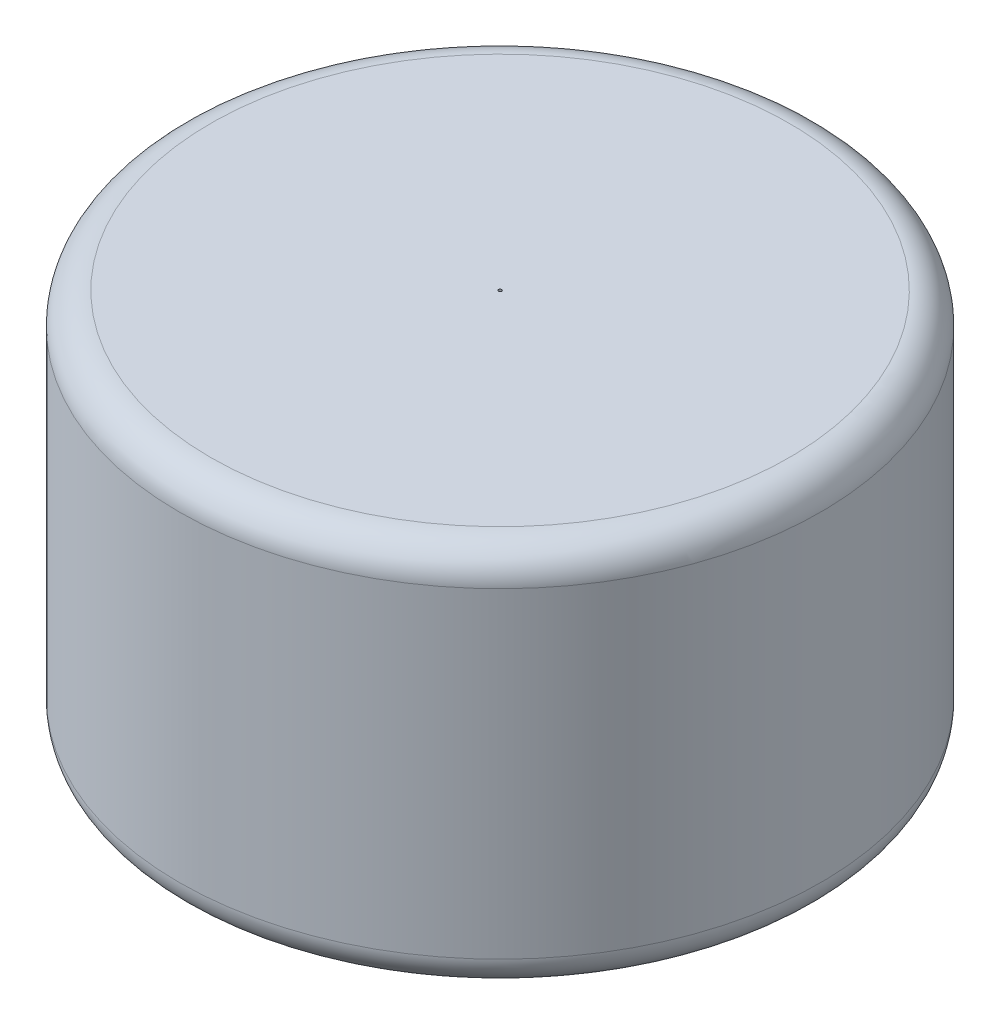
ISO-10303-21;
HEADER;
FILE_DESCRIPTION(('STEP AP214'),'2;1');
FILE_NAME('part.step','',(''),(''),'','','');
FILE_SCHEMA(('AUTOMOTIVE_DESIGN { 1 0 10303 214 1 1 1 1 }'));
ENDSEC;
DATA;
#1=APPLICATION_CONTEXT('core data for automotive mechanical design processes');
#2=APPLICATION_PROTOCOL_DEFINITION('international standard','automotive_design',2000,#1);
#3=PRODUCT_CONTEXT('',#1,'mechanical');
#4=PRODUCT('Part','Part','',(#3));
#5=PRODUCT_RELATED_PRODUCT_CATEGORY('part','',(#4));
#6=PRODUCT_DEFINITION_FORMATION('','',#4);
#7=PRODUCT_DEFINITION_CONTEXT('part definition',#1,'design');
#8=PRODUCT_DEFINITION('design','',#6,#7);
#9=PRODUCT_DEFINITION_SHAPE('','',#8);
#10=(LENGTH_UNIT() NAMED_UNIT(*) SI_UNIT(.MILLI.,.METRE.));
#11=(NAMED_UNIT(*) PLANE_ANGLE_UNIT() SI_UNIT($,.RADIAN.));
#12=(NAMED_UNIT(*) SI_UNIT($,.STERADIAN.) SOLID_ANGLE_UNIT());
#13=UNCERTAINTY_MEASURE_WITH_UNIT(LENGTH_MEASURE(1.E-05),#10,'distance_accuracy_value','');
#14=(GEOMETRIC_REPRESENTATION_CONTEXT(3) GLOBAL_UNCERTAINTY_ASSIGNED_CONTEXT((#13)) GLOBAL_UNIT_ASSIGNED_CONTEXT((#10,
#11,#12)) REPRESENTATION_CONTEXT('',''));
#15=CARTESIAN_POINT('',(0.,0.,0.));
#16=DIRECTION('',(0.,0.,1.));
#17=DIRECTION('',(1.,0.,0.));
#18=AXIS2_PLACEMENT_3D('',#15,#16,#17);
#19=CARTESIAN_POINT('',(0.,51.,0.));
#20=DIRECTION('',(0.,-1.,0.));
#21=DIRECTION('',(0.,0.,-1.));
#22=AXIS2_PLACEMENT_3D('',#19,#20,#21);
#23=PLANE('',#22);
#24=CARTESIAN_POINT('',(0.,51.,0.));
#25=DIRECTION('',(0.,-1.,0.));
#26=DIRECTION('',(0.,0.,-1.));
#27=AXIS2_PLACEMENT_3D('',#24,#25,#26);
#28=CIRCLE('',#27,0.250000000000002);
#29=CARTESIAN_POINT('',(0.,51.,-0.250000000000002));
#30=VERTEX_POINT('',#29);
#31=EDGE_CURVE('E43',#30,#30,#28,.T.);
#32=ORIENTED_EDGE('',*,*,#31,.F.);
#33=EDGE_LOOP('',(#32));
#34=FACE_BOUND('',#33,.T.);
#35=CARTESIAN_POINT('',(0.,51.,0.));
#36=DIRECTION('',(0.,-1.,0.));
#37=DIRECTION('',(0.,0.,-1.));
#38=AXIS2_PLACEMENT_3D('',#35,#36,#37);
#39=CIRCLE('',#38,41.);
#40=CARTESIAN_POINT('',(0.,51.,-41.));
#41=VERTEX_POINT('',#40);
#42=EDGE_CURVE('E63',#41,#41,#39,.T.);
#43=ORIENTED_EDGE('',*,*,#42,.T.);
#44=EDGE_LOOP('',(#43));
#45=FACE_BOUND('',#44,.T.);
#46=ADVANCED_FACE('F39',(#34,#45),#23,.T.);
#47=CARTESIAN_POINT('',(0.,0.,0.));
#48=DIRECTION('',(0.,-1.,0.));
#49=DIRECTION('',(0.,0.,-1.));
#50=AXIS2_PLACEMENT_3D('',#47,#48,#49);
#51=CYLINDRICAL_SURFACE('',#50,41.);
#52=ORIENTED_EDGE('',*,*,#42,.F.);
#53=EDGE_LOOP('',(#52));
#54=FACE_BOUND('',#53,.T.);
#55=CARTESIAN_POINT('',(0.,10.,0.));
#56=DIRECTION('',(0.,-1.,0.));
#57=DIRECTION('',(0.,0.,-1.));
#58=AXIS2_PLACEMENT_3D('',#55,#56,#57);
#59=CIRCLE('',#58,41.);
#60=CARTESIAN_POINT('',(0.,10.,-41.));
#61=VERTEX_POINT('',#60);
#62=EDGE_CURVE('E67',#61,#61,#59,.T.);
#63=ORIENTED_EDGE('',*,*,#62,.T.);
#64=EDGE_LOOP('',(#63));
#65=FACE_BOUND('',#64,.T.);
#66=ADVANCED_FACE('F84',(#54,#65),#51,.F.);
#67=CARTESIAN_POINT('',(0.,10.,0.));
#68=DIRECTION('',(0.,-1.,0.));
#69=DIRECTION('',(0.,0.,-1.));
#70=AXIS2_PLACEMENT_3D('',#67,#68,#69);
#71=PLANE('',#70);
#72=ORIENTED_EDGE('',*,*,#62,.F.);
#73=EDGE_LOOP('',(#72));
#74=FACE_BOUND('',#73,.T.);
#75=ADVANCED_FACE('F90',(#74),#71,.F.);
#76=CARTESIAN_POINT('',(0.,61.,0.));
#77=DIRECTION('',(0.,1.,0.));
#78=DIRECTION('',(0.,0.,1.));
#79=AXIS2_PLACEMENT_3D('',#76,#77,#78);
#80=CYLINDRICAL_SURFACE('',#79,0.250000000000002);
#81=ORIENTED_EDGE('',*,*,#31,.T.);
#82=EDGE_LOOP('',(#81));
#83=FACE_BOUND('',#82,.T.);
#84=CARTESIAN_POINT('',(0.,61.,0.));
#85=DIRECTION('',(0.,1.,0.));
#86=DIRECTION('',(0.,0.,1.));
#87=AXIS2_PLACEMENT_3D('',#84,#85,#86);
#88=CIRCLE('',#87,0.250000000000002);
#89=CARTESIAN_POINT('',(0.,61.,0.250000000000002));
#90=VERTEX_POINT('',#89);
#91=EDGE_CURVE('E71',#90,#90,#88,.T.);
#92=ORIENTED_EDGE('',*,*,#91,.T.);
#93=EDGE_LOOP('',(#92));
#94=FACE_BOUND('',#93,.T.);
#95=ADVANCED_FACE('F80',(#83,#94),#80,.F.);
#96=CARTESIAN_POINT('',(0.,61.,0.));
#97=DIRECTION('',(0.,-1.,0.));
#98=DIRECTION('',(0.,0.,-1.));
#99=AXIS2_PLACEMENT_3D('',#96,#97,#98);
#100=CYLINDRICAL_SURFACE('',#99,51.);
#101=CARTESIAN_POINT('',(0.,5.,0.));
#102=DIRECTION('',(0.,1.,0.));
#103=DIRECTION('',(0.,0.,1.));
#104=AXIS2_PLACEMENT_3D('',#101,#102,#103);
#105=CIRCLE('',#104,51.);
#106=CARTESIAN_POINT('',(0.,5.,51.));
#107=VERTEX_POINT('',#106);
#108=EDGE_CURVE('E53',#107,#107,#105,.T.);
#109=ORIENTED_EDGE('',*,*,#108,.T.);
#110=EDGE_LOOP('',(#109));
#111=FACE_BOUND('',#110,.T.);
#112=CARTESIAN_POINT('',(0.,56.,0.));
#113=DIRECTION('',(0.,1.,0.));
#114=DIRECTION('',(0.,0.,1.));
#115=AXIS2_PLACEMENT_3D('',#112,#113,#114);
#116=CIRCLE('',#115,51.);
#117=CARTESIAN_POINT('',(0.,56.,51.));
#118=VERTEX_POINT('',#117);
#119=EDGE_CURVE('E59',#118,#118,#116,.F.);
#120=ORIENTED_EDGE('',*,*,#119,.T.);
#121=EDGE_LOOP('',(#120));
#122=FACE_BOUND('',#121,.T.);
#123=ADVANCED_FACE('F99',(#111,#122),#100,.T.);
#124=CARTESIAN_POINT('',(0.,61.,0.));
#125=DIRECTION('',(0.,1.,0.));
#126=DIRECTION('',(0.,0.,1.));
#127=AXIS2_PLACEMENT_3D('',#124,#125,#126);
#128=PLANE('',#127);
#129=ORIENTED_EDGE('',*,*,#91,.F.);
#130=EDGE_LOOP('',(#129));
#131=FACE_BOUND('',#130,.T.);
#132=CARTESIAN_POINT('',(0.,61.,0.));
#133=DIRECTION('',(0.,1.,0.));
#134=DIRECTION('',(0.,0.,1.));
#135=AXIS2_PLACEMENT_3D('',#132,#133,#134);
#136=CIRCLE('',#135,46.);
#137=CARTESIAN_POINT('',(0.,61.,46.));
#138=VERTEX_POINT('',#137);
#139=EDGE_CURVE('E10',#138,#138,#136,.T.);
#140=ORIENTED_EDGE('',*,*,#139,.T.);
#141=EDGE_LOOP('',(#140));
#142=FACE_BOUND('',#141,.T.);
#143=ADVANCED_FACE('F102',(#131,#142),#128,.T.);
#144=CARTESIAN_POINT('',(0.,0.,0.));
#145=DIRECTION('',(0.,1.,0.));
#146=DIRECTION('',(0.,0.,1.));
#147=AXIS2_PLACEMENT_3D('',#144,#145,#146);
#148=PLANE('',#147);
#149=CARTESIAN_POINT('',(0.,0.,0.));
#150=DIRECTION('',(0.,1.,0.));
#151=DIRECTION('',(0.,0.,1.));
#152=AXIS2_PLACEMENT_3D('',#149,#150,#151);
#153=CIRCLE('',#152,46.);
#154=CARTESIAN_POINT('',(0.,0.,46.));
#155=VERTEX_POINT('',#154);
#156=EDGE_CURVE('E48',#155,#155,#153,.F.);
#157=ORIENTED_EDGE('',*,*,#156,.T.);
#158=EDGE_LOOP('',(#157));
#159=FACE_BOUND('',#158,.T.);
#160=ADVANCED_FACE('F105',(#159),#148,.F.);
#161=CARTESIAN_POINT('',(0.,5.,0.));
#162=DIRECTION('',(0.,1.,0.));
#163=DIRECTION('',(0.,0.,1.));
#164=AXIS2_PLACEMENT_3D('',#161,#162,#163);
#165=TOROIDAL_SURFACE('',#164,46.,5.);
#166=ORIENTED_EDGE('',*,*,#156,.F.);
#167=EDGE_LOOP('',(#166));
#168=FACE_BOUND('',#167,.T.);
#169=ORIENTED_EDGE('',*,*,#108,.F.);
#170=EDGE_LOOP('',(#169));
#171=FACE_BOUND('',#170,.T.);
#172=ADVANCED_FACE('F109',(#168,#171),#165,.T.);
#173=CARTESIAN_POINT('',(0.,56.,0.));
#174=DIRECTION('',(0.,1.,0.));
#175=DIRECTION('',(0.,0.,1.));
#176=AXIS2_PLACEMENT_3D('',#173,#174,#175);
#177=TOROIDAL_SURFACE('',#176,46.,5.);
#178=ORIENTED_EDGE('',*,*,#119,.F.);
#179=EDGE_LOOP('',(#178));
#180=FACE_BOUND('',#179,.T.);
#181=ORIENTED_EDGE('',*,*,#139,.F.);
#182=EDGE_LOOP('',(#181));
#183=FACE_BOUND('',#182,.T.);
#184=ADVANCED_FACE('F41',(#180,#183),#177,.T.);
#185=CLOSED_SHELL('',(#46,#66,#75,#95,#123,#143,#160,#172,#184));
#186=MANIFOLD_SOLID_BREP('B2',#185);
#187=ADVANCED_BREP_SHAPE_REPRESENTATION('',(#18,#186),#14);
#188=SHAPE_DEFINITION_REPRESENTATION(#9,#187);
ENDSEC;
END-ISO-10303-21;
